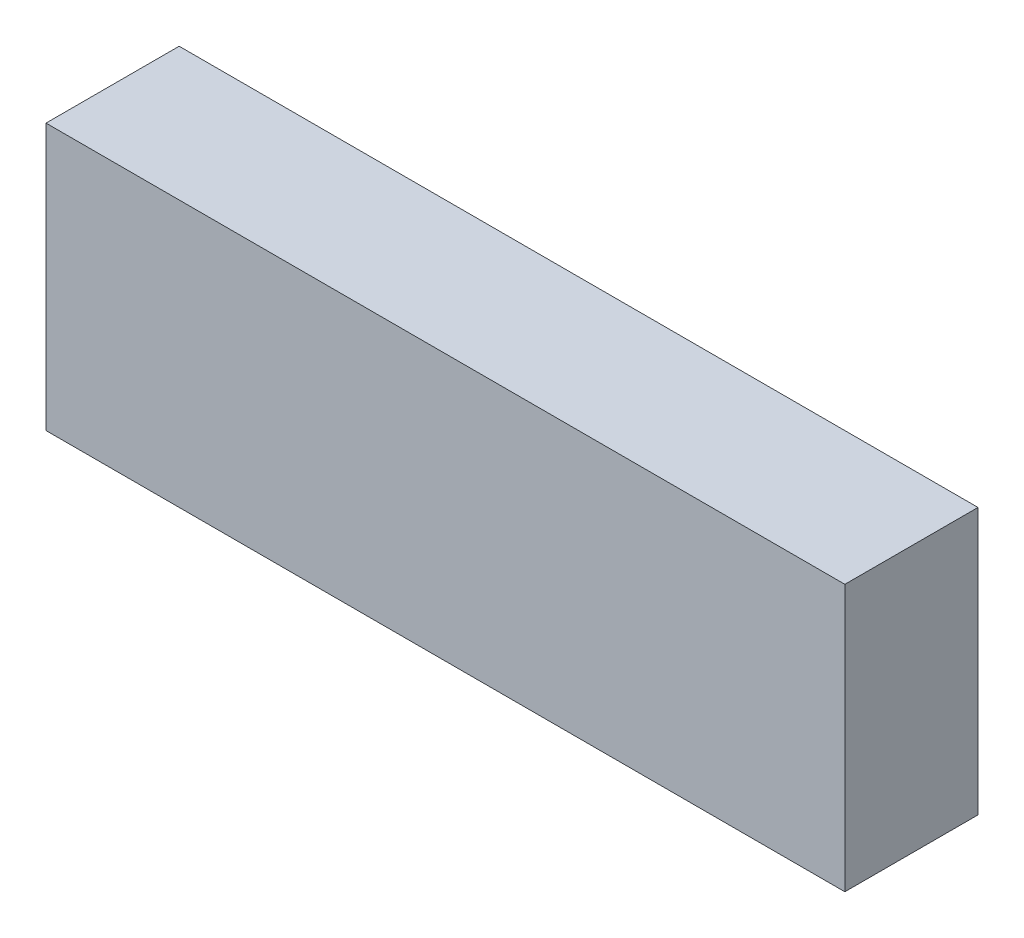
ISO-10303-21;
HEADER;
FILE_DESCRIPTION(('STEP AP214'),'2;1');
FILE_NAME('part.step','',(''),(''),'','','');
FILE_SCHEMA(('AUTOMOTIVE_DESIGN { 1 0 10303 214 1 1 1 1 }'));
ENDSEC;
DATA;
#1=APPLICATION_CONTEXT('core data for automotive mechanical design processes');
#2=APPLICATION_PROTOCOL_DEFINITION('international standard','automotive_design',2000,#1);
#3=PRODUCT_CONTEXT('',#1,'mechanical');
#4=PRODUCT('Part','Part','',(#3));
#5=PRODUCT_RELATED_PRODUCT_CATEGORY('part','',(#4));
#6=PRODUCT_DEFINITION_FORMATION('','',#4);
#7=PRODUCT_DEFINITION_CONTEXT('part definition',#1,'design');
#8=PRODUCT_DEFINITION('design','',#6,#7);
#9=PRODUCT_DEFINITION_SHAPE('','',#8);
#10=(LENGTH_UNIT() NAMED_UNIT(*) SI_UNIT(.MILLI.,.METRE.));
#11=(NAMED_UNIT(*) PLANE_ANGLE_UNIT() SI_UNIT($,.RADIAN.));
#12=(NAMED_UNIT(*) SI_UNIT($,.STERADIAN.) SOLID_ANGLE_UNIT());
#13=UNCERTAINTY_MEASURE_WITH_UNIT(LENGTH_MEASURE(1.E-05),#10,'distance_accuracy_value','');
#14=(GEOMETRIC_REPRESENTATION_CONTEXT(3) GLOBAL_UNCERTAINTY_ASSIGNED_CONTEXT((#13)) GLOBAL_UNIT_ASSIGNED_CONTEXT((#10,
#11,#12)) REPRESENTATION_CONTEXT('',''));
#15=CARTESIAN_POINT('',(0.,0.,0.));
#16=DIRECTION('',(0.,0.,1.));
#17=DIRECTION('',(1.,0.,0.));
#18=AXIS2_PLACEMENT_3D('',#15,#16,#17);
#19=CARTESIAN_POINT('',(-1.975,0.225,0.));
#20=DIRECTION('',(1.,0.,0.));
#21=DIRECTION('',(0.,0.,1.));
#22=AXIS2_PLACEMENT_3D('',#19,#20,#21);
#23=PLANE('',#22);
#24=DIRECTION('',(0.,1.,0.));
#25=VECTOR('',#24,1.);
#26=CARTESIAN_POINT('',(-1.975,0.225,0.1));
#27=LINE('',#26,#25);
#28=CARTESIAN_POINT('',(-1.975,0.225,0.1));
#29=VERTEX_POINT('',#28);
#30=CARTESIAN_POINT('',(-1.975,0.425,0.1));
#31=VERTEX_POINT('',#30);
#32=EDGE_CURVE('E11',#29,#31,#27,.T.);
#33=ORIENTED_EDGE('',*,*,#32,.T.);
#34=DIRECTION('',(0.,0.,1.));
#35=VECTOR('',#34,1.);
#36=CARTESIAN_POINT('',(-1.975,0.425,0.));
#37=LINE('',#36,#35);
#38=CARTESIAN_POINT('',(-1.975,0.425,0.));
#39=VERTEX_POINT('',#38);
#40=EDGE_CURVE('E24',#39,#31,#37,.T.);
#41=ORIENTED_EDGE('',*,*,#40,.F.);
#42=DIRECTION('',(0.,1.,0.));
#43=VECTOR('',#42,1.);
#44=CARTESIAN_POINT('',(-1.975,0.225,0.));
#45=LINE('',#44,#43);
#46=CARTESIAN_POINT('',(-1.975,0.225,0.));
#47=VERTEX_POINT('',#46);
#48=EDGE_CURVE('E86',#47,#39,#45,.T.);
#49=ORIENTED_EDGE('',*,*,#48,.F.);
#50=DIRECTION('',(0.,0.,1.));
#51=VECTOR('',#50,1.);
#52=CARTESIAN_POINT('',(-1.975,0.225,0.));
#53=LINE('',#52,#51);
#54=EDGE_CURVE('E36',#47,#29,#53,.T.);
#55=ORIENTED_EDGE('',*,*,#54,.T.);
#56=EDGE_LOOP('',(#33,#41,#49,#55));
#57=FACE_BOUND('',#56,.T.);
#58=ADVANCED_FACE('F17',(#57),#23,.F.);
#59=CARTESIAN_POINT('',(-1.375,0.225,0.));
#60=DIRECTION('',(1.,0.,0.));
#61=DIRECTION('',(0.,0.,1.));
#62=AXIS2_PLACEMENT_3D('',#59,#60,#61);
#63=PLANE('',#62);
#64=DIRECTION('',(0.,0.,1.));
#65=VECTOR('',#64,1.);
#66=CARTESIAN_POINT('',(-1.375,0.225,0.));
#67=LINE('',#66,#65);
#68=CARTESIAN_POINT('',(-1.375,0.225,0.));
#69=VERTEX_POINT('',#68);
#70=CARTESIAN_POINT('',(-1.375,0.225,0.1));
#71=VERTEX_POINT('',#70);
#72=EDGE_CURVE('E83',#69,#71,#67,.T.);
#73=ORIENTED_EDGE('',*,*,#72,.F.);
#74=DIRECTION('',(0.,1.,0.));
#75=VECTOR('',#74,1.);
#76=CARTESIAN_POINT('',(-1.375,0.225,0.));
#77=LINE('',#76,#75);
#78=CARTESIAN_POINT('',(-1.375,0.425,0.));
#79=VERTEX_POINT('',#78);
#80=EDGE_CURVE('E63',#69,#79,#77,.T.);
#81=ORIENTED_EDGE('',*,*,#80,.T.);
#82=DIRECTION('',(0.,0.,1.));
#83=VECTOR('',#82,1.);
#84=CARTESIAN_POINT('',(-1.375,0.425,0.));
#85=LINE('',#84,#83);
#86=CARTESIAN_POINT('',(-1.375,0.425,0.1));
#87=VERTEX_POINT('',#86);
#88=EDGE_CURVE('E57',#79,#87,#85,.T.);
#89=ORIENTED_EDGE('',*,*,#88,.T.);
#90=DIRECTION('',(0.,1.,0.));
#91=VECTOR('',#90,1.);
#92=CARTESIAN_POINT('',(-1.375,0.225,0.1));
#93=LINE('',#92,#91);
#94=EDGE_CURVE('E60',#71,#87,#93,.T.);
#95=ORIENTED_EDGE('',*,*,#94,.F.);
#96=EDGE_LOOP('',(#73,#81,#89,#95));
#97=FACE_BOUND('',#96,.T.);
#98=ADVANCED_FACE('F59',(#97),#63,.T.);
#99=CARTESIAN_POINT('',(-1.975,0.225,0.));
#100=DIRECTION('',(0.,1.,0.));
#101=DIRECTION('',(0.,0.,1.));
#102=AXIS2_PLACEMENT_3D('',#99,#100,#101);
#103=PLANE('',#102);
#104=ORIENTED_EDGE('',*,*,#72,.T.);
#105=DIRECTION('',(1.,0.,0.));
#106=VECTOR('',#105,1.);
#107=CARTESIAN_POINT('',(-1.975,0.225,0.1));
#108=LINE('',#107,#106);
#109=EDGE_CURVE('E71',#29,#71,#108,.T.);
#110=ORIENTED_EDGE('',*,*,#109,.F.);
#111=ORIENTED_EDGE('',*,*,#54,.F.);
#112=DIRECTION('',(1.,0.,0.));
#113=VECTOR('',#112,1.);
#114=CARTESIAN_POINT('',(-1.975,0.225,0.));
#115=LINE('',#114,#113);
#116=EDGE_CURVE('E76',#47,#69,#115,.T.);
#117=ORIENTED_EDGE('',*,*,#116,.T.);
#118=EDGE_LOOP('',(#104,#110,#111,#117));
#119=FACE_BOUND('',#118,.T.);
#120=ADVANCED_FACE('F91',(#119),#103,.F.);
#121=CARTESIAN_POINT('',(-1.975,0.425,0.));
#122=DIRECTION('',(0.,1.,0.));
#123=DIRECTION('',(0.,0.,1.));
#124=AXIS2_PLACEMENT_3D('',#121,#122,#123);
#125=PLANE('',#124);
#126=DIRECTION('',(1.,0.,0.));
#127=VECTOR('',#126,1.);
#128=CARTESIAN_POINT('',(-1.975,0.425,0.));
#129=LINE('',#128,#127);
#130=EDGE_CURVE('E74',#39,#79,#129,.T.);
#131=ORIENTED_EDGE('',*,*,#130,.F.);
#132=ORIENTED_EDGE('',*,*,#40,.T.);
#133=DIRECTION('',(1.,0.,0.));
#134=VECTOR('',#133,1.);
#135=CARTESIAN_POINT('',(-1.975,0.425,0.1));
#136=LINE('',#135,#134);
#137=EDGE_CURVE('E69',#31,#87,#136,.T.);
#138=ORIENTED_EDGE('',*,*,#137,.T.);
#139=ORIENTED_EDGE('',*,*,#88,.F.);
#140=EDGE_LOOP('',(#131,#132,#138,#139));
#141=FACE_BOUND('',#140,.T.);
#142=ADVANCED_FACE('F73',(#141),#125,.T.);
#143=CARTESIAN_POINT('',(-1.975,0.225,0.));
#144=DIRECTION('',(0.,0.,1.));
#145=DIRECTION('',(1.,0.,0.));
#146=AXIS2_PLACEMENT_3D('',#143,#144,#145);
#147=PLANE('',#146);
#148=ORIENTED_EDGE('',*,*,#130,.T.);
#149=ORIENTED_EDGE('',*,*,#80,.F.);
#150=ORIENTED_EDGE('',*,*,#116,.F.);
#151=ORIENTED_EDGE('',*,*,#48,.T.);
#152=EDGE_LOOP('',(#148,#149,#150,#151));
#153=FACE_BOUND('',#152,.T.);
#154=ADVANCED_FACE('F89',(#153),#147,.F.);
#155=CARTESIAN_POINT('',(-1.975,0.225,0.1));
#156=DIRECTION('',(0.,0.,1.));
#157=DIRECTION('',(1.,0.,0.));
#158=AXIS2_PLACEMENT_3D('',#155,#156,#157);
#159=PLANE('',#158);
#160=ORIENTED_EDGE('',*,*,#32,.F.);
#161=ORIENTED_EDGE('',*,*,#109,.T.);
#162=ORIENTED_EDGE('',*,*,#94,.T.);
#163=ORIENTED_EDGE('',*,*,#137,.F.);
#164=EDGE_LOOP('',(#160,#161,#162,#163));
#165=FACE_BOUND('',#164,.T.);
#166=ADVANCED_FACE('F68',(#165),#159,.T.);
#167=CLOSED_SHELL('',(#58,#98,#120,#142,#154,#166));
#168=MANIFOLD_SOLID_BREP('B1',#167);
#169=ADVANCED_BREP_SHAPE_REPRESENTATION('',(#18,#168),#14);
#170=SHAPE_DEFINITION_REPRESENTATION(#9,#169);
ENDSEC;
END-ISO-10303-21;
